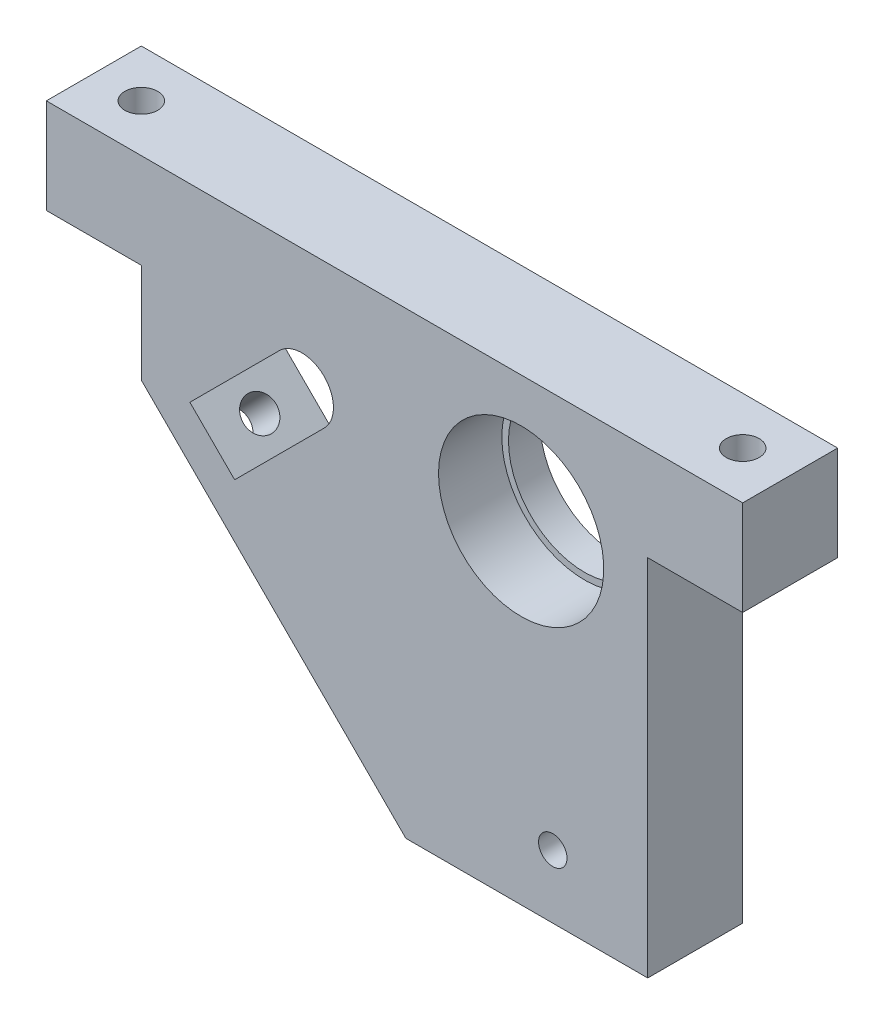
ISO-10303-21;
HEADER;
FILE_DESCRIPTION(('STEP AP214'),'2;1');
FILE_NAME('part.step','',(''),(''),'','','');
FILE_SCHEMA(('AUTOMOTIVE_DESIGN { 1 0 10303 214 1 1 1 1 }'));
ENDSEC;
DATA;
#1=APPLICATION_CONTEXT('core data for automotive mechanical design processes');
#2=APPLICATION_PROTOCOL_DEFINITION('international standard','automotive_design',2000,#1);
#3=PRODUCT_CONTEXT('',#1,'mechanical');
#4=PRODUCT('Part','Part','',(#3));
#5=PRODUCT_RELATED_PRODUCT_CATEGORY('part','',(#4));
#6=PRODUCT_DEFINITION_FORMATION('','',#4);
#7=PRODUCT_DEFINITION_CONTEXT('part definition',#1,'design');
#8=PRODUCT_DEFINITION('design','',#6,#7);
#9=PRODUCT_DEFINITION_SHAPE('','',#8);
#10=(LENGTH_UNIT() NAMED_UNIT(*) SI_UNIT(.MILLI.,.METRE.));
#11=(NAMED_UNIT(*) PLANE_ANGLE_UNIT() SI_UNIT($,.RADIAN.));
#12=(NAMED_UNIT(*) SI_UNIT($,.STERADIAN.) SOLID_ANGLE_UNIT());
#13=UNCERTAINTY_MEASURE_WITH_UNIT(LENGTH_MEASURE(1.E-05),#10,'distance_accuracy_value','');
#14=(GEOMETRIC_REPRESENTATION_CONTEXT(3) GLOBAL_UNCERTAINTY_ASSIGNED_CONTEXT((#13)) GLOBAL_UNIT_ASSIGNED_CONTEXT((#10,
#11,#12)) REPRESENTATION_CONTEXT('',''));
#15=CARTESIAN_POINT('',(0.,0.,0.));
#16=DIRECTION('',(0.,0.,1.));
#17=DIRECTION('',(1.,0.,0.));
#18=AXIS2_PLACEMENT_3D('',#15,#16,#17);
#19=CARTESIAN_POINT('',(0.,0.,15.));
#20=DIRECTION('',(0.,0.,1.));
#21=DIRECTION('',(1.,0.,0.));
#22=AXIS2_PLACEMENT_3D('',#19,#20,#21);
#23=PLANE('',#22);
#24=CARTESIAN_POINT('',(41.1990103270224,21.3834982788296,15.));
#25=DIRECTION('',(0.,0.,-1.));
#26=DIRECTION('',(-1.,0.,0.));
#27=AXIS2_PLACEMENT_3D('',#24,#25,#26);
#28=CIRCLE('',#27,13.05);
#29=CARTESIAN_POINT('',(28.1490103270224,21.3834982788296,15.));
#30=VERTEX_POINT('',#29);
#31=EDGE_CURVE('E241',#30,#30,#28,.T.);
#32=ORIENTED_EDGE('',*,*,#31,.T.);
#33=EDGE_LOOP('',(#32));
#34=FACE_BOUND('',#33,.T.);
#35=DIRECTION('',(0.707106781186547,0.707106781186548,0.));
#36=VECTOR('',#35,1.);
#37=CARTESIAN_POINT('',(-4.05582366891657,4.41293553035246,15.));
#38=LINE('',#37,#36);
#39=CARTESIAN_POINT('',(-4.05582366891657,4.41293553035246,15.));
#40=VERTEX_POINT('',#39);
#41=CARTESIAN_POINT('',(10.0863119548146,18.5550711540836,15.));
#42=VERTEX_POINT('',#41);
#43=EDGE_CURVE('E139',#40,#42,#38,.T.);
#44=ORIENTED_EDGE('',*,*,#43,.F.);
#45=DIRECTION('',(0.707106781186547,-0.707106781186549,0.));
#46=VECTOR('',#45,1.);
#47=CARTESIAN_POINT('',(-11.1268914807821,11.484003342218,15.));
#48=LINE('',#47,#46);
#49=CARTESIAN_POINT('',(-11.1268914807821,11.484003342218,15.));
#50=VERTEX_POINT('',#49);
#51=EDGE_CURVE('E131',#50,#40,#48,.T.);
#52=ORIENTED_EDGE('',*,*,#51,.F.);
#53=DIRECTION('',(-0.707106781186547,-0.707106781186548,0.));
#54=VECTOR('',#53,1.);
#55=CARTESIAN_POINT('',(-11.1268914807821,11.484003342218,15.));
#56=LINE('',#55,#54);
#57=CARTESIAN_POINT('',(3.01524414294889,25.6261389659489,15.));
#58=VERTEX_POINT('',#57);
#59=EDGE_CURVE('E154',#58,#50,#56,.T.);
#60=ORIENTED_EDGE('',*,*,#59,.F.);
#61=CARTESIAN_POINT('',(6.55077804888163,22.0906050600162,15.));
#62=DIRECTION('',(0.,0.,1.));
#63=DIRECTION('',(1.,0.,0.));
#64=AXIS2_PLACEMENT_3D('',#61,#62,#63);
#65=CIRCLE('',#64,5.00000000000001);
#66=EDGE_CURVE('E152',#42,#58,#65,.T.);
#67=ORIENTED_EDGE('',*,*,#66,.F.);
#68=EDGE_LOOP('',(#44,#52,#60,#67));
#69=FACE_BOUND('',#68,.T.);
#70=DIRECTION('',(0.,-1.,0.));
#71=VECTOR('',#70,1.);
#72=CARTESIAN_POINT('',(-33.8009896729777,41.3834982788296,15.));
#73=LINE('',#72,#71);
#74=CARTESIAN_POINT('',(-33.8009896729777,41.3834982788296,15.));
#75=VERTEX_POINT('',#74);
#76=CARTESIAN_POINT('',(-33.8009896729777,26.3834982788296,15.));
#77=VERTEX_POINT('',#76);
#78=EDGE_CURVE('E173',#75,#77,#73,.T.);
#79=ORIENTED_EDGE('',*,*,#78,.T.);
#80=DIRECTION('',(1.,0.,0.));
#81=VECTOR('',#80,1.);
#82=CARTESIAN_POINT('',(-33.8009896729777,26.3834982788296,15.));
#83=LINE('',#82,#81);
#84=CARTESIAN_POINT('',(-18.8009896729777,26.3834982788296,15.));
#85=VERTEX_POINT('',#84);
#86=EDGE_CURVE('E176',#77,#85,#83,.T.);
#87=ORIENTED_EDGE('',*,*,#86,.T.);
#88=DIRECTION('',(0.,-1.,0.));
#89=VECTOR('',#88,1.);
#90=CARTESIAN_POINT('',(-18.8009896729777,26.3834982788296,15.));
#91=LINE('',#90,#89);
#92=CARTESIAN_POINT('',(-18.8009896729777,10.672820160175,15.));
#93=VERTEX_POINT('',#92);
#94=EDGE_CURVE('E179',#85,#93,#91,.T.);
#95=ORIENTED_EDGE('',*,*,#94,.T.);
#96=DIRECTION('',(0.707106781186546,-0.707106781186549,0.));
#97=VECTOR('',#96,1.);
#98=CARTESIAN_POINT('',(-18.8009896729777,10.672820160175,15.));
#99=LINE('',#98,#97);
#100=CARTESIAN_POINT('',(22.9883322083676,-31.1165017211704,15.));
#101=VERTEX_POINT('',#100);
#102=EDGE_CURVE('E181',#93,#101,#99,.T.);
#103=ORIENTED_EDGE('',*,*,#102,.T.);
#104=DIRECTION('',(1.,0.,0.));
#105=VECTOR('',#104,1.);
#106=CARTESIAN_POINT('',(22.9883322083676,-31.1165017211704,15.));
#107=LINE('',#106,#105);
#108=CARTESIAN_POINT('',(61.1990103270224,-31.1165017211704,15.));
#109=VERTEX_POINT('',#108);
#110=EDGE_CURVE('E183',#101,#109,#107,.T.);
#111=ORIENTED_EDGE('',*,*,#110,.T.);
#112=DIRECTION('',(0.,1.,0.));
#113=VECTOR('',#112,1.);
#114=CARTESIAN_POINT('',(61.1990103270224,26.3834982788296,15.));
#115=LINE('',#114,#113);
#116=CARTESIAN_POINT('',(61.1990103270224,26.3834982788296,15.));
#117=VERTEX_POINT('',#116);
#118=EDGE_CURVE('E185',#109,#117,#115,.T.);
#119=ORIENTED_EDGE('',*,*,#118,.T.);
#120=DIRECTION('',(1.,0.,0.));
#121=VECTOR('',#120,1.);
#122=CARTESIAN_POINT('',(76.1990103270224,26.3834982788296,15.));
#123=LINE('',#122,#121);
#124=CARTESIAN_POINT('',(76.1990103270224,26.3834982788296,15.));
#125=VERTEX_POINT('',#124);
#126=EDGE_CURVE('E187',#117,#125,#123,.T.);
#127=ORIENTED_EDGE('',*,*,#126,.T.);
#128=DIRECTION('',(0.,1.,0.));
#129=VECTOR('',#128,1.);
#130=CARTESIAN_POINT('',(76.1990103270224,41.3834982788296,15.));
#131=LINE('',#130,#129);
#132=CARTESIAN_POINT('',(76.1990103270224,41.3834982788296,15.));
#133=VERTEX_POINT('',#132);
#134=EDGE_CURVE('E189',#125,#133,#131,.T.);
#135=ORIENTED_EDGE('',*,*,#134,.T.);
#136=DIRECTION('',(-1.,0.,0.));
#137=VECTOR('',#136,1.);
#138=CARTESIAN_POINT('',(56.1990103270223,41.3834982788296,15.));
#139=LINE('',#138,#137);
#140=EDGE_CURVE('E191',#133,#75,#139,.T.);
#141=ORIENTED_EDGE('',*,*,#140,.T.);
#142=EDGE_LOOP('',(#79,#87,#95,#103,#111,#119,#127,#135,#141));
#143=FACE_BOUND('',#142,.T.);
#144=CARTESIAN_POINT('',(46.1990103270224,-21.1165017211704,15.));
#145=DIRECTION('',(0.,0.,1.));
#146=DIRECTION('',(1.,0.,0.));
#147=AXIS2_PLACEMENT_3D('',#144,#145,#146);
#148=CIRCLE('',#147,2.25);
#149=CARTESIAN_POINT('',(48.4490103270224,-21.1165017211704,15.));
#150=VERTEX_POINT('',#149);
#151=EDGE_CURVE('E160',#150,#150,#148,.T.);
#152=ORIENTED_EDGE('',*,*,#151,.F.);
#153=EDGE_LOOP('',(#152));
#154=FACE_BOUND('',#153,.T.);
#155=ADVANCED_FACE('F34',(#34,#69,#143,#154),#23,.T.);
#156=CARTESIAN_POINT('',(0.,0.,0.));
#157=DIRECTION('',(0.,0.,1.));
#158=DIRECTION('',(1.,0.,0.));
#159=AXIS2_PLACEMENT_3D('',#156,#157,#158);
#160=PLANE('',#159);
#161=CARTESIAN_POINT('',(41.1990103270224,21.3834982788296,0.));
#162=DIRECTION('',(0.,0.,1.));
#163=DIRECTION('',(1.,0.,0.));
#164=AXIS2_PLACEMENT_3D('',#161,#162,#163);
#165=CIRCLE('',#164,12.);
#166=CARTESIAN_POINT('',(53.1990103270224,21.3834982788296,0.));
#167=VERTEX_POINT('',#166);
#168=EDGE_CURVE('E147',#167,#167,#165,.T.);
#169=ORIENTED_EDGE('',*,*,#168,.T.);
#170=EDGE_LOOP('',(#169));
#171=FACE_BOUND('',#170,.T.);
#172=DIRECTION('',(0.,-1.,0.));
#173=VECTOR('',#172,1.);
#174=CARTESIAN_POINT('',(-33.8009896729777,41.3834982788296,0.));
#175=LINE('',#174,#173);
#176=CARTESIAN_POINT('',(-33.8009896729777,41.3834982788296,0.));
#177=VERTEX_POINT('',#176);
#178=CARTESIAN_POINT('',(-33.8009896729777,26.3834982788296,0.));
#179=VERTEX_POINT('',#178);
#180=EDGE_CURVE('E172',#177,#179,#175,.T.);
#181=ORIENTED_EDGE('',*,*,#180,.F.);
#182=DIRECTION('',(-1.,0.,0.));
#183=VECTOR('',#182,1.);
#184=CARTESIAN_POINT('',(-33.8009896729777,41.3834982788296,0.));
#185=LINE('',#184,#183);
#186=CARTESIAN_POINT('',(76.1990103270224,41.3834982788296,0.));
#187=VERTEX_POINT('',#186);
#188=EDGE_CURVE('E177',#187,#177,#185,.T.);
#189=ORIENTED_EDGE('',*,*,#188,.F.);
#190=DIRECTION('',(0.,1.,0.));
#191=VECTOR('',#190,1.);
#192=CARTESIAN_POINT('',(76.1990103270224,41.3834982788296,0.));
#193=LINE('',#192,#191);
#194=CARTESIAN_POINT('',(76.1990103270224,26.3834982788296,0.));
#195=VERTEX_POINT('',#194);
#196=EDGE_CURVE('E208',#195,#187,#193,.T.);
#197=ORIENTED_EDGE('',*,*,#196,.F.);
#198=DIRECTION('',(1.,0.,0.));
#199=VECTOR('',#198,1.);
#200=CARTESIAN_POINT('',(76.1990103270224,26.3834982788296,0.));
#201=LINE('',#200,#199);
#202=CARTESIAN_POINT('',(61.1990103270224,26.3834982788296,0.));
#203=VERTEX_POINT('',#202);
#204=EDGE_CURVE('E206',#203,#195,#201,.T.);
#205=ORIENTED_EDGE('',*,*,#204,.F.);
#206=DIRECTION('',(0.,1.,0.));
#207=VECTOR('',#206,1.);
#208=CARTESIAN_POINT('',(61.1990103270224,26.3834982788296,0.));
#209=LINE('',#208,#207);
#210=CARTESIAN_POINT('',(61.1990103270224,-31.1165017211704,0.));
#211=VERTEX_POINT('',#210);
#212=EDGE_CURVE('E204',#211,#203,#209,.T.);
#213=ORIENTED_EDGE('',*,*,#212,.F.);
#214=DIRECTION('',(1.,0.,0.));
#215=VECTOR('',#214,1.);
#216=CARTESIAN_POINT('',(22.9883322083676,-31.1165017211704,0.));
#217=LINE('',#216,#215);
#218=CARTESIAN_POINT('',(22.9883322083676,-31.1165017211704,0.));
#219=VERTEX_POINT('',#218);
#220=EDGE_CURVE('E202',#219,#211,#217,.T.);
#221=ORIENTED_EDGE('',*,*,#220,.F.);
#222=DIRECTION('',(0.707106781186546,-0.707106781186549,0.));
#223=VECTOR('',#222,1.);
#224=CARTESIAN_POINT('',(-18.8009896729777,10.672820160175,0.));
#225=LINE('',#224,#223);
#226=CARTESIAN_POINT('',(-18.8009896729777,10.672820160175,0.));
#227=VERTEX_POINT('',#226);
#228=EDGE_CURVE('E200',#227,#219,#225,.T.);
#229=ORIENTED_EDGE('',*,*,#228,.F.);
#230=DIRECTION('',(0.,-1.,0.));
#231=VECTOR('',#230,1.);
#232=CARTESIAN_POINT('',(-18.8009896729777,26.3834982788296,0.));
#233=LINE('',#232,#231);
#234=CARTESIAN_POINT('',(-18.8009896729777,26.3834982788296,0.));
#235=VERTEX_POINT('',#234);
#236=EDGE_CURVE('E198',#235,#227,#233,.T.);
#237=ORIENTED_EDGE('',*,*,#236,.F.);
#238=DIRECTION('',(1.,0.,0.));
#239=VECTOR('',#238,1.);
#240=CARTESIAN_POINT('',(-27.4405999797669,26.3834982788296,0.));
#241=LINE('',#240,#239);
#242=EDGE_CURVE('E196',#179,#235,#241,.T.);
#243=ORIENTED_EDGE('',*,*,#242,.F.);
#244=EDGE_LOOP('',(#181,#189,#197,#205,#213,#221,#229,#237,#243));
#245=FACE_BOUND('',#244,.T.);
#246=DIRECTION('',(0.707106781186547,-0.707106781186549,0.));
#247=VECTOR('',#246,1.);
#248=CARTESIAN_POINT('',(-11.1268914807821,11.484003342218,0.));
#249=LINE('',#248,#247);
#250=CARTESIAN_POINT('',(-11.1268914807821,11.484003342218,0.));
#251=VERTEX_POINT('',#250);
#252=CARTESIAN_POINT('',(-4.05582366891657,4.41293553035246,0.));
#253=VERTEX_POINT('',#252);
#254=EDGE_CURVE('E59',#251,#253,#249,.T.);
#255=ORIENTED_EDGE('',*,*,#254,.T.);
#256=DIRECTION('',(0.707106781186547,0.707106781186548,0.));
#257=VECTOR('',#256,1.);
#258=CARTESIAN_POINT('',(-4.05582366891657,4.41293553035246,0.));
#259=LINE('',#258,#257);
#260=CARTESIAN_POINT('',(10.0863119548146,18.5550711540836,0.));
#261=VERTEX_POINT('',#260);
#262=EDGE_CURVE('E146',#253,#261,#259,.T.);
#263=ORIENTED_EDGE('',*,*,#262,.T.);
#264=CARTESIAN_POINT('',(6.55077804888163,22.0906050600162,0.));
#265=DIRECTION('',(0.,0.,1.));
#266=DIRECTION('',(1.,0.,0.));
#267=AXIS2_PLACEMENT_3D('',#264,#265,#266);
#268=CIRCLE('',#267,5.00000000000001);
#269=CARTESIAN_POINT('',(3.01524414294889,25.6261389659489,0.));
#270=VERTEX_POINT('',#269);
#271=EDGE_CURVE('E162',#261,#270,#268,.T.);
#272=ORIENTED_EDGE('',*,*,#271,.T.);
#273=DIRECTION('',(-0.707106781186547,-0.707106781186548,0.));
#274=VECTOR('',#273,1.);
#275=CARTESIAN_POINT('',(-11.1268914807821,11.484003342218,0.));
#276=LINE('',#275,#274);
#277=EDGE_CURVE('E140',#270,#251,#276,.T.);
#278=ORIENTED_EDGE('',*,*,#277,.T.);
#279=EDGE_LOOP('',(#255,#263,#272,#278));
#280=FACE_BOUND('',#279,.T.);
#281=CARTESIAN_POINT('',(46.1990103270224,-21.1165017211704,0.));
#282=DIRECTION('',(0.,0.,1.));
#283=DIRECTION('',(1.,0.,0.));
#284=AXIS2_PLACEMENT_3D('',#281,#282,#283);
#285=CIRCLE('',#284,2.25);
#286=CARTESIAN_POINT('',(48.4490103270224,-21.1165017211704,0.));
#287=VERTEX_POINT('',#286);
#288=EDGE_CURVE('E235',#287,#287,#285,.T.);
#289=ORIENTED_EDGE('',*,*,#288,.T.);
#290=EDGE_LOOP('',(#289));
#291=FACE_BOUND('',#290,.T.);
#292=ADVANCED_FACE('F258',(#171,#245,#280,#291),#160,.F.);
#293=CARTESIAN_POINT('',(-33.8009896729777,41.3834982788296,15.));
#294=DIRECTION('',(1.,0.,0.));
#295=DIRECTION('',(0.,1.,0.));
#296=AXIS2_PLACEMENT_3D('',#293,#294,#295);
#297=PLANE('',#296);
#298=ORIENTED_EDGE('',*,*,#180,.T.);
#299=DIRECTION('',(0.,0.,-1.));
#300=VECTOR('',#299,1.);
#301=CARTESIAN_POINT('',(-33.8009896729777,26.3834982788296,15.));
#302=LINE('',#301,#300);
#303=EDGE_CURVE('E11',#77,#179,#302,.T.);
#304=ORIENTED_EDGE('',*,*,#303,.F.);
#305=ORIENTED_EDGE('',*,*,#78,.F.);
#306=DIRECTION('',(0.,0.,-1.));
#307=VECTOR('',#306,1.);
#308=CARTESIAN_POINT('',(-33.8009896729777,41.3834982788296,15.));
#309=LINE('',#308,#307);
#310=EDGE_CURVE('E193',#75,#177,#309,.T.);
#311=ORIENTED_EDGE('',*,*,#310,.T.);
#312=EDGE_LOOP('',(#298,#304,#305,#311));
#313=FACE_BOUND('',#312,.T.);
#314=ADVANCED_FACE('F36',(#313),#297,.F.);
#315=CARTESIAN_POINT('',(-27.4405999797669,26.3834982788296,15.));
#316=DIRECTION('',(0.,1.,0.));
#317=DIRECTION('',(0.,0.,1.));
#318=AXIS2_PLACEMENT_3D('',#315,#316,#317);
#319=PLANE('',#318);
#320=CARTESIAN_POINT('',(-26.3009896729777,26.3834982788296,7.5));
#321=DIRECTION('',(0.,1.,0.));
#322=DIRECTION('',(0.,0.,1.));
#323=AXIS2_PLACEMENT_3D('',#320,#321,#322);
#324=CIRCLE('',#323,2.6);
#325=CARTESIAN_POINT('',(-26.3009896729777,26.3834982788296,10.1));
#326=VERTEX_POINT('',#325);
#327=EDGE_CURVE('E246',#326,#326,#324,.T.);
#328=ORIENTED_EDGE('',*,*,#327,.T.);
#329=EDGE_LOOP('',(#328));
#330=FACE_BOUND('',#329,.T.);
#331=ORIENTED_EDGE('',*,*,#242,.T.);
#332=DIRECTION('',(0.,0.,-1.));
#333=VECTOR('',#332,1.);
#334=CARTESIAN_POINT('',(-18.8009896729777,26.3834982788296,15.));
#335=LINE('',#334,#333);
#336=EDGE_CURVE('E43',#85,#235,#335,.T.);
#337=ORIENTED_EDGE('',*,*,#336,.F.);
#338=ORIENTED_EDGE('',*,*,#86,.F.);
#339=ORIENTED_EDGE('',*,*,#303,.T.);
#340=EDGE_LOOP('',(#331,#337,#338,#339));
#341=FACE_BOUND('',#340,.T.);
#342=ADVANCED_FACE('F296',(#330,#341),#319,.F.);
#343=CARTESIAN_POINT('',(-18.8009896729777,26.3834982788296,15.));
#344=DIRECTION('',(1.,0.,0.));
#345=DIRECTION('',(0.,1.,0.));
#346=AXIS2_PLACEMENT_3D('',#343,#344,#345);
#347=PLANE('',#346);
#348=ORIENTED_EDGE('',*,*,#236,.T.);
#349=DIRECTION('',(0.,0.,-1.));
#350=VECTOR('',#349,1.);
#351=CARTESIAN_POINT('',(-18.8009896729777,10.672820160175,15.));
#352=LINE('',#351,#350);
#353=EDGE_CURVE('E229',#93,#227,#352,.T.);
#354=ORIENTED_EDGE('',*,*,#353,.F.);
#355=ORIENTED_EDGE('',*,*,#94,.F.);
#356=ORIENTED_EDGE('',*,*,#336,.T.);
#357=EDGE_LOOP('',(#348,#354,#355,#356));
#358=FACE_BOUND('',#357,.T.);
#359=ADVANCED_FACE('F293',(#358),#347,.F.);
#360=CARTESIAN_POINT('',(-18.8009896729777,10.672820160175,15.));
#361=DIRECTION('',(0.707106781186549,0.707106781186546,0.));
#362=DIRECTION('',(-0.707106781186546,0.707106781186549,0.));
#363=AXIS2_PLACEMENT_3D('',#360,#361,#362);
#364=PLANE('',#363);
#365=CARTESIAN_POINT('',(-11.8359878782902,3.70781836548751,7.5));
#366=DIRECTION('',(-0.707106781186548,-0.707106781186547,0.));
#367=DIRECTION('',(0.707106781186547,-0.707106781186548,0.));
#368=AXIS2_PLACEMENT_3D('',#365,#366,#367);
#369=CIRCLE('',#368,2.6);
#370=CARTESIAN_POINT('',(-9.99751024720517,1.86934073440249,7.5));
#371=VERTEX_POINT('',#370);
#372=EDGE_CURVE('E366',#371,#371,#369,.T.);
#373=ORIENTED_EDGE('',*,*,#372,.F.);
#374=EDGE_LOOP('',(#373));
#375=FACE_BOUND('',#374,.T.);
#376=ORIENTED_EDGE('',*,*,#228,.T.);
#377=DIRECTION('',(0.,0.,-1.));
#378=VECTOR('',#377,1.);
#379=CARTESIAN_POINT('',(22.9883322083676,-31.1165017211704,15.));
#380=LINE('',#379,#378);
#381=EDGE_CURVE('E226',#101,#219,#380,.T.);
#382=ORIENTED_EDGE('',*,*,#381,.F.);
#383=ORIENTED_EDGE('',*,*,#102,.F.);
#384=ORIENTED_EDGE('',*,*,#353,.T.);
#385=EDGE_LOOP('',(#376,#382,#383,#384));
#386=FACE_BOUND('',#385,.T.);
#387=ADVANCED_FACE('F289',(#375,#386),#364,.F.);
#388=CARTESIAN_POINT('',(22.9883322083676,-31.1165017211704,15.));
#389=DIRECTION('',(0.,1.,0.));
#390=DIRECTION('',(0.,0.,1.));
#391=AXIS2_PLACEMENT_3D('',#388,#389,#390);
#392=PLANE('',#391);
#393=ORIENTED_EDGE('',*,*,#220,.T.);
#394=DIRECTION('',(0.,0.,-1.));
#395=VECTOR('',#394,1.);
#396=CARTESIAN_POINT('',(61.1990103270224,-31.1165017211704,15.));
#397=LINE('',#396,#395);
#398=EDGE_CURVE('E223',#109,#211,#397,.T.);
#399=ORIENTED_EDGE('',*,*,#398,.F.);
#400=ORIENTED_EDGE('',*,*,#110,.F.);
#401=ORIENTED_EDGE('',*,*,#381,.T.);
#402=EDGE_LOOP('',(#393,#399,#400,#401));
#403=FACE_BOUND('',#402,.T.);
#404=ADVANCED_FACE('F285',(#403),#392,.F.);
#405=CARTESIAN_POINT('',(61.1990103270224,26.3834982788296,15.));
#406=DIRECTION('',(-1.,0.,0.));
#407=DIRECTION('',(0.,-1.,0.));
#408=AXIS2_PLACEMENT_3D('',#405,#406,#407);
#409=PLANE('',#408);
#410=ORIENTED_EDGE('',*,*,#212,.T.);
#411=DIRECTION('',(0.,0.,-1.));
#412=VECTOR('',#411,1.);
#413=CARTESIAN_POINT('',(61.1990103270224,26.3834982788296,15.));
#414=LINE('',#413,#412);
#415=EDGE_CURVE('E220',#117,#203,#414,.T.);
#416=ORIENTED_EDGE('',*,*,#415,.F.);
#417=ORIENTED_EDGE('',*,*,#118,.F.);
#418=ORIENTED_EDGE('',*,*,#398,.T.);
#419=EDGE_LOOP('',(#410,#416,#417,#418));
#420=FACE_BOUND('',#419,.T.);
#421=ADVANCED_FACE('F281',(#420),#409,.F.);
#422=CARTESIAN_POINT('',(76.1990103270224,26.3834982788296,15.));
#423=DIRECTION('',(0.,1.,0.));
#424=DIRECTION('',(-1.,0.,0.));
#425=AXIS2_PLACEMENT_3D('',#422,#423,#424);
#426=PLANE('',#425);
#427=CARTESIAN_POINT('',(68.6990103270224,26.3834982788296,7.5));
#428=DIRECTION('',(0.,1.,0.));
#429=DIRECTION('',(-1.,0.,0.));
#430=AXIS2_PLACEMENT_3D('',#427,#428,#429);
#431=CIRCLE('',#430,2.6);
#432=CARTESIAN_POINT('',(66.0990103270224,26.3834982788296,7.5));
#433=VERTEX_POINT('',#432);
#434=EDGE_CURVE('E376',#433,#433,#431,.T.);
#435=ORIENTED_EDGE('',*,*,#434,.T.);
#436=EDGE_LOOP('',(#435));
#437=FACE_BOUND('',#436,.T.);
#438=ORIENTED_EDGE('',*,*,#204,.T.);
#439=DIRECTION('',(0.,0.,-1.));
#440=VECTOR('',#439,1.);
#441=CARTESIAN_POINT('',(76.1990103270224,26.3834982788296,15.));
#442=LINE('',#441,#440);
#443=EDGE_CURVE('E217',#125,#195,#442,.T.);
#444=ORIENTED_EDGE('',*,*,#443,.F.);
#445=ORIENTED_EDGE('',*,*,#126,.F.);
#446=ORIENTED_EDGE('',*,*,#415,.T.);
#447=EDGE_LOOP('',(#438,#444,#445,#446));
#448=FACE_BOUND('',#447,.T.);
#449=ADVANCED_FACE('F277',(#437,#448),#426,.F.);
#450=CARTESIAN_POINT('',(76.1990103270224,41.3834982788296,15.));
#451=DIRECTION('',(-1.,0.,0.));
#452=DIRECTION('',(0.,0.,1.));
#453=AXIS2_PLACEMENT_3D('',#450,#451,#452);
#454=PLANE('',#453);
#455=ORIENTED_EDGE('',*,*,#196,.T.);
#456=DIRECTION('',(0.,0.,-1.));
#457=VECTOR('',#456,1.);
#458=CARTESIAN_POINT('',(76.1990103270224,41.3834982788296,15.));
#459=LINE('',#458,#457);
#460=EDGE_CURVE('E214',#133,#187,#459,.T.);
#461=ORIENTED_EDGE('',*,*,#460,.F.);
#462=ORIENTED_EDGE('',*,*,#134,.F.);
#463=ORIENTED_EDGE('',*,*,#443,.T.);
#464=EDGE_LOOP('',(#455,#461,#462,#463));
#465=FACE_BOUND('',#464,.T.);
#466=ADVANCED_FACE('F273',(#465),#454,.F.);
#467=CARTESIAN_POINT('',(-33.8009896729777,41.3834982788296,15.));
#468=DIRECTION('',(0.,-1.,0.));
#469=DIRECTION('',(0.,0.,-1.));
#470=AXIS2_PLACEMENT_3D('',#467,#468,#469);
#471=PLANE('',#470);
#472=CARTESIAN_POINT('',(-26.3009896729777,41.3834982788296,7.5));
#473=DIRECTION('',(0.,1.,0.));
#474=DIRECTION('',(0.,0.,1.));
#475=AXIS2_PLACEMENT_3D('',#472,#473,#474);
#476=CIRCLE('',#475,2.6);
#477=CARTESIAN_POINT('',(-26.3009896729777,41.3834982788296,10.1));
#478=VERTEX_POINT('',#477);
#479=EDGE_CURVE('E368',#478,#478,#476,.T.);
#480=ORIENTED_EDGE('',*,*,#479,.F.);
#481=EDGE_LOOP('',(#480));
#482=FACE_BOUND('',#481,.T.);
#483=CARTESIAN_POINT('',(68.6990103270224,41.3834982788296,7.5));
#484=DIRECTION('',(0.,1.,0.));
#485=DIRECTION('',(0.,0.,1.));
#486=AXIS2_PLACEMENT_3D('',#483,#484,#485);
#487=CIRCLE('',#486,2.6);
#488=CARTESIAN_POINT('',(68.6990103270224,41.3834982788296,10.1));
#489=VERTEX_POINT('',#488);
#490=EDGE_CURVE('E365',#489,#489,#487,.T.);
#491=ORIENTED_EDGE('',*,*,#490,.F.);
#492=EDGE_LOOP('',(#491));
#493=FACE_BOUND('',#492,.T.);
#494=ORIENTED_EDGE('',*,*,#188,.T.);
#495=ORIENTED_EDGE('',*,*,#310,.F.);
#496=ORIENTED_EDGE('',*,*,#140,.F.);
#497=ORIENTED_EDGE('',*,*,#460,.T.);
#498=EDGE_LOOP('',(#494,#495,#496,#497));
#499=FACE_BOUND('',#498,.T.);
#500=ADVANCED_FACE('F270',(#482,#493,#499),#471,.F.);
#501=CARTESIAN_POINT('',(41.1990103270224,21.3834982788296,15.));
#502=DIRECTION('',(0.,0.,-1.));
#503=DIRECTION('',(-1.,0.,0.));
#504=AXIS2_PLACEMENT_3D('',#501,#502,#503);
#505=CYLINDRICAL_SURFACE('',#504,12.);
#506=CARTESIAN_POINT('',(41.1990103270224,21.3834982788296,5.));
#507=DIRECTION('',(0.,0.,-1.));
#508=DIRECTION('',(-1.,0.,0.));
#509=AXIS2_PLACEMENT_3D('',#506,#507,#508);
#510=CIRCLE('',#509,12.);
#511=CARTESIAN_POINT('',(29.1990103270224,21.3834982788296,5.));
#512=VERTEX_POINT('',#511);
#513=EDGE_CURVE('E233',#512,#512,#510,.T.);
#514=ORIENTED_EDGE('',*,*,#513,.F.);
#515=EDGE_LOOP('',(#514));
#516=FACE_BOUND('',#515,.T.);
#517=ORIENTED_EDGE('',*,*,#168,.F.);
#518=EDGE_LOOP('',(#517));
#519=FACE_BOUND('',#518,.T.);
#520=ADVANCED_FACE('F267',(#516,#519),#505,.F.);
#521=CARTESIAN_POINT('',(-11.1268914807821,11.484003342218,15.));
#522=DIRECTION('',(0.707106781186549,0.707106781186547,0.));
#523=DIRECTION('',(-0.707106781186547,0.707106781186549,0.));
#524=AXIS2_PLACEMENT_3D('',#521,#522,#523);
#525=PLANE('',#524);
#526=CARTESIAN_POINT('',(-7.5933471911709,7.9504590526068,7.5));
#527=DIRECTION('',(0.707106781186549,0.707106781186547,0.));
#528=DIRECTION('',(-0.707106781186547,0.707106781186549,0.));
#529=AXIS2_PLACEMENT_3D('',#526,#527,#528);
#530=CIRCLE('',#529,2.6);
#531=CARTESIAN_POINT('',(-9.43182482225592,9.78893668369182,7.5));
#532=VERTEX_POINT('',#531);
#533=EDGE_CURVE('E38',#532,#532,#530,.T.);
#534=ORIENTED_EDGE('',*,*,#533,.F.);
#535=EDGE_LOOP('',(#534));
#536=FACE_BOUND('',#535,.T.);
#537=ORIENTED_EDGE('',*,*,#254,.F.);
#538=DIRECTION('',(0.,0.,-1.));
#539=VECTOR('',#538,1.);
#540=CARTESIAN_POINT('',(-11.1268914807821,11.484003342218,15.));
#541=LINE('',#540,#539);
#542=EDGE_CURVE('E135',#50,#251,#541,.T.);
#543=ORIENTED_EDGE('',*,*,#542,.F.);
#544=ORIENTED_EDGE('',*,*,#51,.T.);
#545=DIRECTION('',(0.,0.,-1.));
#546=VECTOR('',#545,1.);
#547=CARTESIAN_POINT('',(-4.05582366891657,4.41293553035246,15.));
#548=LINE('',#547,#546);
#549=EDGE_CURVE('E134',#40,#253,#548,.T.);
#550=ORIENTED_EDGE('',*,*,#549,.T.);
#551=EDGE_LOOP('',(#537,#543,#544,#550));
#552=FACE_BOUND('',#551,.T.);
#553=ADVANCED_FACE('F133',(#536,#552),#525,.T.);
#554=CARTESIAN_POINT('',(-4.05582366891657,4.41293553035246,15.));
#555=DIRECTION('',(-0.707106781186548,0.707106781186547,0.));
#556=DIRECTION('',(-0.707106781186547,-0.707106781186548,0.));
#557=AXIS2_PLACEMENT_3D('',#554,#555,#556);
#558=PLANE('',#557);
#559=ORIENTED_EDGE('',*,*,#262,.F.);
#560=ORIENTED_EDGE('',*,*,#549,.F.);
#561=ORIENTED_EDGE('',*,*,#43,.T.);
#562=DIRECTION('',(0.,0.,-1.));
#563=VECTOR('',#562,1.);
#564=CARTESIAN_POINT('',(10.0863119548146,18.5550711540836,15.));
#565=LINE('',#564,#563);
#566=EDGE_CURVE('E148',#42,#261,#565,.T.);
#567=ORIENTED_EDGE('',*,*,#566,.T.);
#568=EDGE_LOOP('',(#559,#560,#561,#567));
#569=FACE_BOUND('',#568,.T.);
#570=ADVANCED_FACE('F143',(#569),#558,.T.);
#571=CARTESIAN_POINT('',(6.55077804888163,22.0906050600162,15.));
#572=DIRECTION('',(0.,0.,-1.));
#573=DIRECTION('',(-1.,0.,0.));
#574=AXIS2_PLACEMENT_3D('',#571,#572,#573);
#575=CYLINDRICAL_SURFACE('',#574,5.00000000000001);
#576=ORIENTED_EDGE('',*,*,#271,.F.);
#577=ORIENTED_EDGE('',*,*,#566,.F.);
#578=ORIENTED_EDGE('',*,*,#66,.T.);
#579=DIRECTION('',(0.,0.,-1.));
#580=VECTOR('',#579,1.);
#581=CARTESIAN_POINT('',(3.01524414294889,25.6261389659489,15.));
#582=LINE('',#581,#580);
#583=EDGE_CURVE('E51',#58,#270,#582,.T.);
#584=ORIENTED_EDGE('',*,*,#583,.T.);
#585=EDGE_LOOP('',(#576,#577,#578,#584));
#586=FACE_BOUND('',#585,.T.);
#587=ADVANCED_FACE('F348',(#586),#575,.F.);
#588=CARTESIAN_POINT('',(-11.1268914807821,11.484003342218,15.));
#589=DIRECTION('',(0.707106781186548,-0.707106781186547,0.));
#590=DIRECTION('',(0.707106781186547,0.707106781186548,0.));
#591=AXIS2_PLACEMENT_3D('',#588,#589,#590);
#592=PLANE('',#591);
#593=ORIENTED_EDGE('',*,*,#277,.F.);
#594=ORIENTED_EDGE('',*,*,#583,.F.);
#595=ORIENTED_EDGE('',*,*,#59,.T.);
#596=ORIENTED_EDGE('',*,*,#542,.T.);
#597=EDGE_LOOP('',(#593,#594,#595,#596));
#598=FACE_BOUND('',#597,.T.);
#599=ADVANCED_FACE('F340',(#598),#592,.T.);
#600=CARTESIAN_POINT('',(46.1990103270224,-21.1165017211704,15.));
#601=DIRECTION('',(0.,0.,-1.));
#602=DIRECTION('',(-1.,0.,0.));
#603=AXIS2_PLACEMENT_3D('',#600,#601,#602);
#604=CYLINDRICAL_SURFACE('',#603,2.25);
#605=ORIENTED_EDGE('',*,*,#151,.T.);
#606=EDGE_LOOP('',(#605));
#607=FACE_BOUND('',#606,.T.);
#608=ORIENTED_EDGE('',*,*,#288,.F.);
#609=EDGE_LOOP('',(#608));
#610=FACE_BOUND('',#609,.T.);
#611=ADVANCED_FACE('F254',(#607,#610),#604,.F.);
#612=CARTESIAN_POINT('',(41.1990103270224,21.3834982788296,5.));
#613=DIRECTION('',(0.,0.,1.));
#614=DIRECTION('',(1.,0.,0.));
#615=AXIS2_PLACEMENT_3D('',#612,#613,#614);
#616=CYLINDRICAL_SURFACE('',#615,13.05);
#617=CARTESIAN_POINT('',(41.1990103270224,21.3834982788296,5.));
#618=DIRECTION('',(0.,0.,-1.));
#619=DIRECTION('',(-1.,0.,0.));
#620=AXIS2_PLACEMENT_3D('',#617,#618,#619);
#621=CIRCLE('',#620,13.05);
#622=CARTESIAN_POINT('',(28.1490103270224,21.3834982788296,5.));
#623=VERTEX_POINT('',#622);
#624=EDGE_CURVE('E236',#623,#623,#621,.T.);
#625=ORIENTED_EDGE('',*,*,#624,.T.);
#626=EDGE_LOOP('',(#625));
#627=FACE_BOUND('',#626,.T.);
#628=ORIENTED_EDGE('',*,*,#31,.F.);
#629=EDGE_LOOP('',(#628));
#630=FACE_BOUND('',#629,.T.);
#631=ADVANCED_FACE('F339',(#627,#630),#616,.F.);
#632=CARTESIAN_POINT('',(41.1990103270224,21.3834982788296,5.));
#633=DIRECTION('',(0.,0.,-1.));
#634=DIRECTION('',(-1.,0.,0.));
#635=AXIS2_PLACEMENT_3D('',#632,#633,#634);
#636=PLANE('',#635);
#637=ORIENTED_EDGE('',*,*,#513,.T.);
#638=EDGE_LOOP('',(#637));
#639=FACE_BOUND('',#638,.T.);
#640=ORIENTED_EDGE('',*,*,#624,.F.);
#641=EDGE_LOOP('',(#640));
#642=FACE_BOUND('',#641,.T.);
#643=ADVANCED_FACE('F346',(#639,#642),#636,.F.);
#644=CARTESIAN_POINT('',(68.6990103270224,-31.1165017211704,7.5));
#645=DIRECTION('',(0.,1.,0.));
#646=DIRECTION('',(0.,0.,1.));
#647=AXIS2_PLACEMENT_3D('',#644,#645,#646);
#648=CYLINDRICAL_SURFACE('',#647,2.6);
#649=ORIENTED_EDGE('',*,*,#490,.T.);
#650=EDGE_LOOP('',(#649));
#651=FACE_BOUND('',#650,.T.);
#652=ORIENTED_EDGE('',*,*,#434,.F.);
#653=EDGE_LOOP('',(#652));
#654=FACE_BOUND('',#653,.T.);
#655=ADVANCED_FACE('F380',(#651,#654),#648,.F.);
#656=CARTESIAN_POINT('',(-26.3009896729777,-31.1165017211704,7.5));
#657=DIRECTION('',(0.,1.,0.));
#658=DIRECTION('',(0.,0.,1.));
#659=AXIS2_PLACEMENT_3D('',#656,#657,#658);
#660=CYLINDRICAL_SURFACE('',#659,2.6);
#661=ORIENTED_EDGE('',*,*,#479,.T.);
#662=EDGE_LOOP('',(#661));
#663=FACE_BOUND('',#662,.T.);
#664=ORIENTED_EDGE('',*,*,#327,.F.);
#665=EDGE_LOOP('',(#664));
#666=FACE_BOUND('',#665,.T.);
#667=ADVANCED_FACE('F382',(#663,#666),#660,.F.);
#668=CARTESIAN_POINT('',(-4.76492006642471,10.778886177353,7.5));
#669=DIRECTION('',(-0.707106781186548,-0.707106781186547,0.));
#670=DIRECTION('',(0.707106781186547,-0.707106781186548,0.));
#671=AXIS2_PLACEMENT_3D('',#668,#669,#670);
#672=CYLINDRICAL_SURFACE('',#671,2.6);
#673=ORIENTED_EDGE('',*,*,#533,.T.);
#674=EDGE_LOOP('',(#673));
#675=FACE_BOUND('',#674,.T.);
#676=ORIENTED_EDGE('',*,*,#372,.T.);
#677=EDGE_LOOP('',(#676));
#678=FACE_BOUND('',#677,.T.);
#679=ADVANCED_FACE('F389',(#675,#678),#672,.F.);
#680=CLOSED_SHELL('',(#155,#292,#314,#342,#359,#387,#404,#421,#449,#466,#500,#520,#553,#570,
#587,#599,#611,#631,#643,#655,#667,#679));
#681=MANIFOLD_SOLID_BREP('B2',#680);
#682=ADVANCED_BREP_SHAPE_REPRESENTATION('',(#18,#681),#14);
#683=SHAPE_DEFINITION_REPRESENTATION(#9,#682);
ENDSEC;
END-ISO-10303-21;
